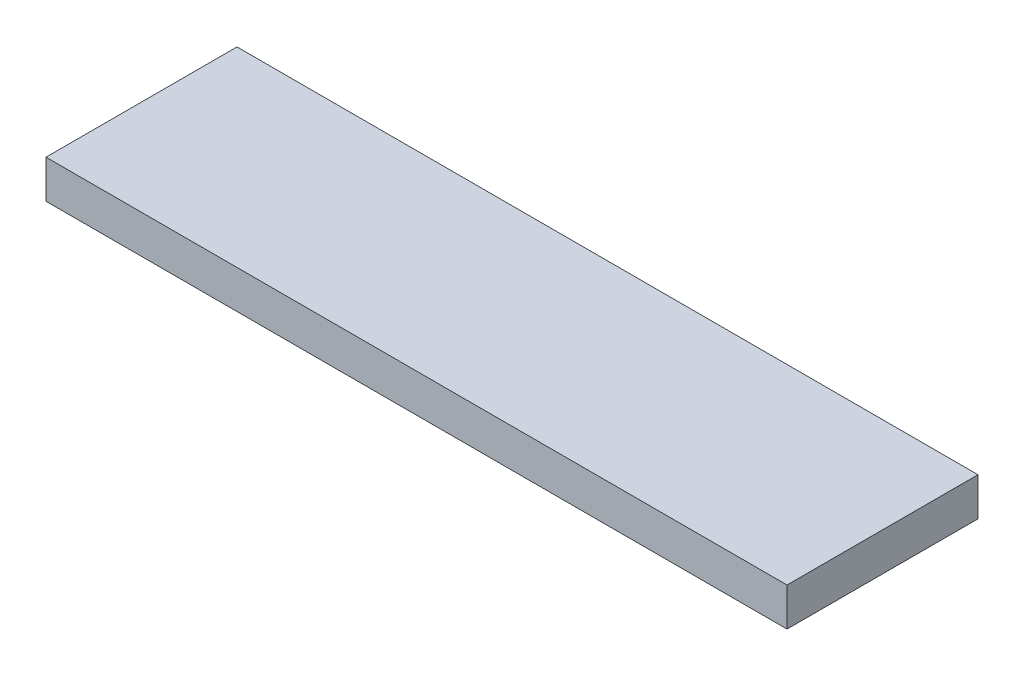
ISO-10303-21;
HEADER;
FILE_DESCRIPTION(('STEP AP214'),'2;1');
FILE_NAME('part.step','',(''),(''),'','','');
FILE_SCHEMA(('AUTOMOTIVE_DESIGN { 1 0 10303 214 1 1 1 1 }'));
ENDSEC;
DATA;
#1=APPLICATION_CONTEXT('core data for automotive mechanical design processes');
#2=APPLICATION_PROTOCOL_DEFINITION('international standard','automotive_design',2000,#1);
#3=PRODUCT_CONTEXT('',#1,'mechanical');
#4=PRODUCT('Part','Part','',(#3));
#5=PRODUCT_RELATED_PRODUCT_CATEGORY('part','',(#4));
#6=PRODUCT_DEFINITION_FORMATION('','',#4);
#7=PRODUCT_DEFINITION_CONTEXT('part definition',#1,'design');
#8=PRODUCT_DEFINITION('design','',#6,#7);
#9=PRODUCT_DEFINITION_SHAPE('','',#8);
#10=(LENGTH_UNIT() NAMED_UNIT(*) SI_UNIT(.MILLI.,.METRE.));
#11=(NAMED_UNIT(*) PLANE_ANGLE_UNIT() SI_UNIT($,.RADIAN.));
#12=(NAMED_UNIT(*) SI_UNIT($,.STERADIAN.) SOLID_ANGLE_UNIT());
#13=UNCERTAINTY_MEASURE_WITH_UNIT(LENGTH_MEASURE(1.E-05),#10,'distance_accuracy_value','');
#14=(GEOMETRIC_REPRESENTATION_CONTEXT(3) GLOBAL_UNCERTAINTY_ASSIGNED_CONTEXT((#13)) GLOBAL_UNIT_ASSIGNED_CONTEXT((#10,
#11,#12)) REPRESENTATION_CONTEXT('',''));
#15=CARTESIAN_POINT('',(0.,0.,0.));
#16=DIRECTION('',(0.,0.,1.));
#17=DIRECTION('',(1.,0.,0.));
#18=AXIS2_PLACEMENT_3D('',#15,#16,#17);
#19=CARTESIAN_POINT('',(0.,10.,0.));
#20=DIRECTION('',(0.,1.,0.));
#21=DIRECTION('',(0.,0.,1.));
#22=AXIS2_PLACEMENT_3D('',#19,#20,#21);
#23=PLANE('',#22);
#24=DIRECTION('',(-1.,0.,0.));
#25=VECTOR('',#24,1.);
#26=CARTESIAN_POINT('',(97.,10.,-25.));
#27=LINE('',#26,#25);
#28=CARTESIAN_POINT('',(-97.,10.,-25.));
#29=VERTEX_POINT('',#28);
#30=CARTESIAN_POINT('',(97.,10.,-25.));
#31=VERTEX_POINT('',#30);
#32=EDGE_CURVE('E67',#29,#31,#27,.F.);
#33=ORIENTED_EDGE('',*,*,#32,.F.);
#34=DIRECTION('',(0.,0.,1.));
#35=VECTOR('',#34,1.);
#36=CARTESIAN_POINT('',(-97.,10.,-25.));
#37=LINE('',#36,#35);
#38=CARTESIAN_POINT('',(-97.,10.,25.));
#39=VERTEX_POINT('',#38);
#40=EDGE_CURVE('E19',#39,#29,#37,.F.);
#41=ORIENTED_EDGE('',*,*,#40,.F.);
#42=DIRECTION('',(1.,0.,0.));
#43=VECTOR('',#42,1.);
#44=CARTESIAN_POINT('',(-97.,10.,25.));
#45=LINE('',#44,#43);
#46=CARTESIAN_POINT('',(97.,10.,25.));
#47=VERTEX_POINT('',#46);
#48=EDGE_CURVE('E57',#47,#39,#45,.F.);
#49=ORIENTED_EDGE('',*,*,#48,.F.);
#50=DIRECTION('',(0.,0.,-1.));
#51=VECTOR('',#50,1.);
#52=CARTESIAN_POINT('',(97.,10.,25.));
#53=LINE('',#52,#51);
#54=EDGE_CURVE('E52',#31,#47,#53,.F.);
#55=ORIENTED_EDGE('',*,*,#54,.F.);
#56=EDGE_LOOP('',(#33,#41,#49,#55));
#57=FACE_BOUND('',#56,.T.);
#58=ADVANCED_FACE('F16',(#57),#23,.T.);
#59=CARTESIAN_POINT('',(-97.,0.,-25.));
#60=DIRECTION('',(-1.,0.,0.));
#61=DIRECTION('',(0.,0.,1.));
#62=AXIS2_PLACEMENT_3D('',#59,#60,#61);
#63=PLANE('',#62);
#64=DIRECTION('',(0.,1.,0.));
#65=VECTOR('',#64,1.);
#66=CARTESIAN_POINT('',(-97.,0.,-25.));
#67=LINE('',#66,#65);
#68=CARTESIAN_POINT('',(-97.,0.,-25.));
#69=VERTEX_POINT('',#68);
#70=EDGE_CURVE('E78',#69,#29,#67,.T.);
#71=ORIENTED_EDGE('',*,*,#70,.F.);
#72=DIRECTION('',(0.,0.,1.));
#73=VECTOR('',#72,1.);
#74=CARTESIAN_POINT('',(-97.,0.,0.));
#75=LINE('',#74,#73);
#76=CARTESIAN_POINT('',(-97.,0.,25.));
#77=VERTEX_POINT('',#76);
#78=EDGE_CURVE('E73',#69,#77,#75,.T.);
#79=ORIENTED_EDGE('',*,*,#78,.T.);
#80=DIRECTION('',(0.,1.,0.));
#81=VECTOR('',#80,1.);
#82=CARTESIAN_POINT('',(-97.,0.,25.));
#83=LINE('',#82,#81);
#84=EDGE_CURVE('E62',#39,#77,#83,.F.);
#85=ORIENTED_EDGE('',*,*,#84,.F.);
#86=ORIENTED_EDGE('',*,*,#40,.T.);
#87=EDGE_LOOP('',(#71,#79,#85,#86));
#88=FACE_BOUND('',#87,.T.);
#89=ADVANCED_FACE('F72',(#88),#63,.T.);
#90=CARTESIAN_POINT('',(-97.,0.,25.));
#91=DIRECTION('',(0.,0.,1.));
#92=DIRECTION('',(1.,0.,0.));
#93=AXIS2_PLACEMENT_3D('',#90,#91,#92);
#94=PLANE('',#93);
#95=ORIENTED_EDGE('',*,*,#84,.T.);
#96=DIRECTION('',(1.,0.,0.));
#97=VECTOR('',#96,1.);
#98=CARTESIAN_POINT('',(0.,0.,25.));
#99=LINE('',#98,#97);
#100=CARTESIAN_POINT('',(97.,0.,25.));
#101=VERTEX_POINT('',#100);
#102=EDGE_CURVE('E83',#77,#101,#99,.T.);
#103=ORIENTED_EDGE('',*,*,#102,.T.);
#104=DIRECTION('',(0.,1.,0.));
#105=VECTOR('',#104,1.);
#106=CARTESIAN_POINT('',(97.,0.,25.));
#107=LINE('',#106,#105);
#108=EDGE_CURVE('E64',#47,#101,#107,.F.);
#109=ORIENTED_EDGE('',*,*,#108,.F.);
#110=ORIENTED_EDGE('',*,*,#48,.T.);
#111=EDGE_LOOP('',(#95,#103,#109,#110));
#112=FACE_BOUND('',#111,.T.);
#113=ADVANCED_FACE('F59',(#112),#94,.T.);
#114=CARTESIAN_POINT('',(97.,0.,25.));
#115=DIRECTION('',(1.,0.,0.));
#116=DIRECTION('',(0.,0.,-1.));
#117=AXIS2_PLACEMENT_3D('',#114,#115,#116);
#118=PLANE('',#117);
#119=ORIENTED_EDGE('',*,*,#108,.T.);
#120=DIRECTION('',(0.,0.,1.));
#121=VECTOR('',#120,1.);
#122=CARTESIAN_POINT('',(97.,0.,0.));
#123=LINE('',#122,#121);
#124=CARTESIAN_POINT('',(97.,0.,-25.));
#125=VERTEX_POINT('',#124);
#126=EDGE_CURVE('E25',#101,#125,#123,.F.);
#127=ORIENTED_EDGE('',*,*,#126,.T.);
#128=DIRECTION('',(0.,1.,0.));
#129=VECTOR('',#128,1.);
#130=CARTESIAN_POINT('',(97.,0.,-25.));
#131=LINE('',#130,#129);
#132=EDGE_CURVE('E33',#31,#125,#131,.F.);
#133=ORIENTED_EDGE('',*,*,#132,.F.);
#134=ORIENTED_EDGE('',*,*,#54,.T.);
#135=EDGE_LOOP('',(#119,#127,#133,#134));
#136=FACE_BOUND('',#135,.T.);
#137=ADVANCED_FACE('F87',(#136),#118,.T.);
#138=CARTESIAN_POINT('',(97.,0.,-25.));
#139=DIRECTION('',(0.,0.,-1.));
#140=DIRECTION('',(-1.,0.,0.));
#141=AXIS2_PLACEMENT_3D('',#138,#139,#140);
#142=PLANE('',#141);
#143=ORIENTED_EDGE('',*,*,#132,.T.);
#144=DIRECTION('',(1.,0.,0.));
#145=VECTOR('',#144,1.);
#146=CARTESIAN_POINT('',(0.,0.,-25.));
#147=LINE('',#146,#145);
#148=EDGE_CURVE('E11',#125,#69,#147,.F.);
#149=ORIENTED_EDGE('',*,*,#148,.T.);
#150=ORIENTED_EDGE('',*,*,#70,.T.);
#151=ORIENTED_EDGE('',*,*,#32,.T.);
#152=EDGE_LOOP('',(#143,#149,#150,#151));
#153=FACE_BOUND('',#152,.T.);
#154=ADVANCED_FACE('F90',(#153),#142,.T.);
#155=CARTESIAN_POINT('',(0.,0.,0.));
#156=DIRECTION('',(0.,1.,0.));
#157=DIRECTION('',(0.,0.,1.));
#158=AXIS2_PLACEMENT_3D('',#155,#156,#157);
#159=PLANE('',#158);
#160=ORIENTED_EDGE('',*,*,#126,.F.);
#161=ORIENTED_EDGE('',*,*,#102,.F.);
#162=ORIENTED_EDGE('',*,*,#78,.F.);
#163=ORIENTED_EDGE('',*,*,#148,.F.);
#164=EDGE_LOOP('',(#160,#161,#162,#163));
#165=FACE_BOUND('',#164,.T.);
#166=ADVANCED_FACE('F89',(#165),#159,.F.);
#167=CLOSED_SHELL('',(#58,#89,#113,#137,#154,#166));
#168=MANIFOLD_SOLID_BREP('B1',#167);
#169=ADVANCED_BREP_SHAPE_REPRESENTATION('',(#18,#168),#14);
#170=SHAPE_DEFINITION_REPRESENTATION(#9,#169);
ENDSEC;
END-ISO-10303-21;
